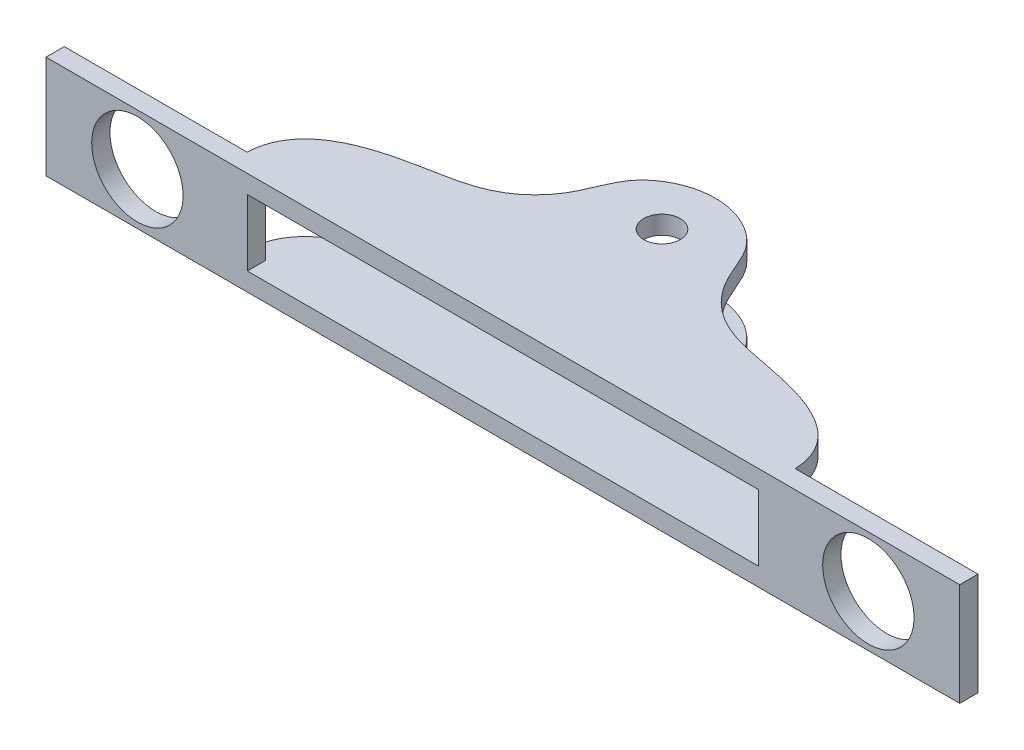
ISO-10303-21;
HEADER;
FILE_DESCRIPTION(('STEP AP214'),'2;1');
FILE_NAME('part.step','',(''),(''),'','','');
FILE_SCHEMA(('AUTOMOTIVE_DESIGN { 1 0 10303 214 1 1 1 1 }'));
ENDSEC;
DATA;
#1=APPLICATION_CONTEXT('core data for automotive mechanical design processes');
#2=APPLICATION_PROTOCOL_DEFINITION('international standard','automotive_design',2000,#1);
#3=PRODUCT_CONTEXT('',#1,'mechanical');
#4=PRODUCT('Part','Part','',(#3));
#5=PRODUCT_RELATED_PRODUCT_CATEGORY('part','',(#4));
#6=PRODUCT_DEFINITION_FORMATION('','',#4);
#7=PRODUCT_DEFINITION_CONTEXT('part definition',#1,'design');
#8=PRODUCT_DEFINITION('design','',#6,#7);
#9=PRODUCT_DEFINITION_SHAPE('','',#8);
#10=(LENGTH_UNIT() NAMED_UNIT(*) SI_UNIT(.MILLI.,.METRE.));
#11=(NAMED_UNIT(*) PLANE_ANGLE_UNIT() SI_UNIT($,.RADIAN.));
#12=(NAMED_UNIT(*) SI_UNIT($,.STERADIAN.) SOLID_ANGLE_UNIT());
#13=UNCERTAINTY_MEASURE_WITH_UNIT(LENGTH_MEASURE(1.E-05),#10,'distance_accuracy_value','');
#14=(GEOMETRIC_REPRESENTATION_CONTEXT(3) GLOBAL_UNCERTAINTY_ASSIGNED_CONTEXT((#13)) GLOBAL_UNIT_ASSIGNED_CONTEXT((#10,
#11,#12)) REPRESENTATION_CONTEXT('',''));
#15=CARTESIAN_POINT('',(0.,0.,0.));
#16=DIRECTION('',(0.,0.,1.));
#17=DIRECTION('',(1.,0.,0.));
#18=AXIS2_PLACEMENT_3D('',#15,#16,#17);
#19=CARTESIAN_POINT('',(0.,3.571875,0.));
#20=DIRECTION('',(0.,0.,-1.));
#21=DIRECTION('',(-1.,0.,0.));
#22=AXIS2_PLACEMENT_3D('',#19,#20,#21);
#23=PLANE('',#22);
#24=CARTESIAN_POINT('',(-25.4,0.,0.));
#25=DIRECTION('',(0.,0.,-1.));
#26=DIRECTION('',(-1.,0.,0.));
#27=AXIS2_PLACEMENT_3D('',#24,#25,#26);
#28=CIRCLE('',#27,3.175);
#29=CARTESIAN_POINT('',(-28.575,0.,0.));
#30=VERTEX_POINT('',#29);
#31=EDGE_CURVE('E244',#30,#30,#28,.T.);
#32=ORIENTED_EDGE('',*,*,#31,.F.);
#33=EDGE_LOOP('',(#32));
#34=FACE_BOUND('',#33,.T.);
#35=DIRECTION('',(0.,1.,0.));
#36=VECTOR('',#35,1.);
#37=CARTESIAN_POINT('',(-17.7571230411786,2.301875,0.));
#38=LINE('',#37,#36);
#39=CARTESIAN_POINT('',(-17.7571230411786,-2.301875,0.));
#40=VERTEX_POINT('',#39);
#41=CARTESIAN_POINT('',(-17.7571230411786,2.301875,0.));
#42=VERTEX_POINT('',#41);
#43=EDGE_CURVE('E58',#40,#42,#38,.T.);
#44=ORIENTED_EDGE('',*,*,#43,.F.);
#45=DIRECTION('',(1.,0.,0.));
#46=VECTOR('',#45,1.);
#47=CARTESIAN_POINT('',(0.,-2.301875,0.));
#48=LINE('',#47,#46);
#49=CARTESIAN_POINT('',(-19.05,-2.301875,0.));
#50=VERTEX_POINT('',#49);
#51=EDGE_CURVE('E247',#50,#40,#48,.T.);
#52=ORIENTED_EDGE('',*,*,#51,.F.);
#53=DIRECTION('',(0.,-1.,0.));
#54=VECTOR('',#53,1.);
#55=CARTESIAN_POINT('',(-19.05,3.571875,0.));
#56=LINE('',#55,#54);
#57=CARTESIAN_POINT('',(-19.05,-3.571875,0.));
#58=VERTEX_POINT('',#57);
#59=EDGE_CURVE('E43',#50,#58,#56,.T.);
#60=ORIENTED_EDGE('',*,*,#59,.T.);
#61=DIRECTION('',(1.,0.,0.));
#62=VECTOR('',#61,1.);
#63=CARTESIAN_POINT('',(0.,-3.571875,0.));
#64=LINE('',#63,#62);
#65=CARTESIAN_POINT('',(-31.75,-3.571875,0.));
#66=VERTEX_POINT('',#65);
#67=EDGE_CURVE('E275',#66,#58,#64,.T.);
#68=ORIENTED_EDGE('',*,*,#67,.F.);
#69=DIRECTION('',(0.,-1.,0.));
#70=VECTOR('',#69,1.);
#71=CARTESIAN_POINT('',(-31.75,3.571875,0.));
#72=LINE('',#71,#70);
#73=CARTESIAN_POINT('',(-31.75,3.571875,0.));
#74=VERTEX_POINT('',#73);
#75=EDGE_CURVE('E319',#74,#66,#72,.T.);
#76=ORIENTED_EDGE('',*,*,#75,.F.);
#77=DIRECTION('',(1.,0.,0.));
#78=VECTOR('',#77,1.);
#79=CARTESIAN_POINT('',(0.,3.571875,0.));
#80=LINE('',#79,#78);
#81=CARTESIAN_POINT('',(-19.05,3.571875,0.));
#82=VERTEX_POINT('',#81);
#83=EDGE_CURVE('E183',#74,#82,#80,.T.);
#84=ORIENTED_EDGE('',*,*,#83,.T.);
#85=CARTESIAN_POINT('',(-19.05,2.301875,0.));
#86=VERTEX_POINT('',#85);
#87=EDGE_CURVE('E11',#82,#86,#56,.T.);
#88=ORIENTED_EDGE('',*,*,#87,.T.);
#89=DIRECTION('',(1.,0.,0.));
#90=VECTOR('',#89,1.);
#91=CARTESIAN_POINT('',(0.,2.301875,0.));
#92=LINE('',#91,#90);
#93=EDGE_CURVE('E158',#86,#42,#92,.T.);
#94=ORIENTED_EDGE('',*,*,#93,.T.);
#95=EDGE_LOOP('',(#44,#52,#60,#68,#76,#84,#88,#94));
#96=FACE_BOUND('',#95,.T.);
#97=ADVANCED_FACE('F34',(#34,#96),#23,.T.);
#98=CARTESIAN_POINT('',(-19.05,3.571875,0.));
#99=CARTESIAN_POINT('',(-18.924950207043,3.571875,-3.11249948959949));
#100=CARTESIAN_POINT('',(-13.8713765267056,3.571875,-5.18268485097122));
#101=CARTESIAN_POINT('',(-8.10041814641702,3.571875,-5.64069188478516));
#102=CARTESIAN_POINT('',(-5.15048706248962,3.571875,-8.71077390469013));
#103=CARTESIAN_POINT('',(-4.23378700622328,3.571875,-12.3346141955239));
#104=CARTESIAN_POINT('',(-1.46476598899125,3.571875,-13.5252143206023));
#105=CARTESIAN_POINT('',(0.,3.571875,-13.4974805585162));
#106=B_SPLINE_CURVE_WITH_KNOTS('',3,(#98,#99,#100,#101,#102,#103,#104,#105),.UNSPECIFIED.,.F.,
.F.,(4,1,1,1,1,4),(0.,0.332448712043005,0.564615598907575,0.691987457165884,0.817131748018574,
1.),.UNSPECIFIED.);
#107=DIRECTION('',(0.,-1.,0.));
#108=VECTOR('',#107,1.);
#109=SURFACE_OF_LINEAR_EXTRUSION('',#106,#108);
#110=ORIENTED_EDGE('',*,*,#59,.F.);
#111=CARTESIAN_POINT('',(-19.05,-2.301875,0.));
#112=CARTESIAN_POINT('',(-18.924950207043,-2.301875,-3.11249948959949));
#113=CARTESIAN_POINT('',(-13.8713765267056,-2.301875,-5.18268485097122));
#114=CARTESIAN_POINT('',(-8.10041814641702,-2.301875,-5.64069188478516));
#115=CARTESIAN_POINT('',(-5.15048706248962,-2.301875,-8.71077390469013));
#116=CARTESIAN_POINT('',(-4.23378700622328,-2.301875,-12.3346141955239));
#117=CARTESIAN_POINT('',(-1.46476598899125,-2.301875,-13.5252143206023));
#118=CARTESIAN_POINT('',(0.,-2.301875,-13.4974805585162));
#119=B_SPLINE_CURVE_WITH_KNOTS('',3,(#111,#112,#113,#114,#115,#116,#117,#118),.UNSPECIFIED.,.F.,
.F.,(4,1,1,1,1,4),(0.,0.332448712043005,0.564615598907575,0.691987457165884,0.817131748018574,
1.),.UNSPECIFIED.);
#120=CARTESIAN_POINT('',(0.,-2.301875,-13.4974805585162));
#121=VERTEX_POINT('',#120);
#122=EDGE_CURVE('E176',#50,#121,#119,.T.);
#123=ORIENTED_EDGE('',*,*,#122,.T.);
#124=DIRECTION('',(0.,-1.,0.));
#125=VECTOR('',#124,1.);
#126=CARTESIAN_POINT('',(0.,3.571875,-13.4974805585162));
#127=LINE('',#126,#125);
#128=CARTESIAN_POINT('',(0.,-3.571875,-13.4974805585162));
#129=VERTEX_POINT('',#128);
#130=EDGE_CURVE('E309',#121,#129,#127,.T.);
#131=ORIENTED_EDGE('',*,*,#130,.T.);
#132=CARTESIAN_POINT('',(-19.05,-3.571875,0.));
#133=CARTESIAN_POINT('',(-18.924950207043,-3.571875,-3.11249948959949));
#134=CARTESIAN_POINT('',(-13.8713765267056,-3.571875,-5.18268485097122));
#135=CARTESIAN_POINT('',(-8.10041814641702,-3.571875,-5.64069188478516));
#136=CARTESIAN_POINT('',(-5.15048706248962,-3.571875,-8.71077390469013));
#137=CARTESIAN_POINT('',(-4.23378700622328,-3.571875,-12.3346141955239));
#138=CARTESIAN_POINT('',(-1.46476598899125,-3.571875,-13.5252143206023));
#139=CARTESIAN_POINT('',(0.,-3.571875,-13.4974805585162));
#140=B_SPLINE_CURVE_WITH_KNOTS('',3,(#132,#133,#134,#135,#136,#137,#138,#139),.UNSPECIFIED.,.F.,
.F.,(4,1,1,1,1,4),(0.,0.332448712043005,0.564615598907575,0.691987457165884,0.817131748018574,
1.),.UNSPECIFIED.);
#141=EDGE_CURVE('E271',#58,#129,#140,.T.);
#142=ORIENTED_EDGE('',*,*,#141,.F.);
#143=EDGE_LOOP('',(#110,#123,#131,#142));
#144=FACE_BOUND('',#143,.T.);
#145=ADVANCED_FACE('F234',(#144),#109,.T.);
#146=CARTESIAN_POINT('',(19.05,3.571875,0.));
#147=CARTESIAN_POINT('',(18.924950207043,3.571875,-3.11249948959949));
#148=CARTESIAN_POINT('',(13.8713765267056,3.571875,-5.18268485097123));
#149=CARTESIAN_POINT('',(8.10041814641702,3.571875,-5.64069188478516));
#150=CARTESIAN_POINT('',(5.15048706248962,3.571875,-8.71077390469013));
#151=CARTESIAN_POINT('',(4.23378700622328,3.571875,-12.3346141955239));
#152=CARTESIAN_POINT('',(1.46476598899125,3.571875,-13.5252143206023));
#153=CARTESIAN_POINT('',(0.,3.571875,-13.4974805585162));
#154=B_SPLINE_CURVE_WITH_KNOTS('',3,(#146,#147,#148,#149,#150,#151,#152,#153),.UNSPECIFIED.,.F.,
.F.,(4,1,1,1,1,4),(0.,0.332448712043005,0.564615598907575,0.691987457165884,0.817131748018574,
1.),.UNSPECIFIED.);
#155=DIRECTION('',(0.,-1.,0.));
#156=VECTOR('',#155,1.);
#157=SURFACE_OF_LINEAR_EXTRUSION('',#154,#156);
#158=CARTESIAN_POINT('',(19.05,-2.301875,0.));
#159=CARTESIAN_POINT('',(18.924950207043,-2.301875,-3.11249948959949));
#160=CARTESIAN_POINT('',(13.8713765267056,-2.301875,-5.18268485097123));
#161=CARTESIAN_POINT('',(8.10041814641702,-2.301875,-5.64069188478516));
#162=CARTESIAN_POINT('',(5.15048706248962,-2.301875,-8.71077390469013));
#163=CARTESIAN_POINT('',(4.23378700622328,-2.301875,-12.3346141955239));
#164=CARTESIAN_POINT('',(1.46476598899125,-2.301875,-13.5252143206023));
#165=CARTESIAN_POINT('',(0.,-2.301875,-13.4974805585162));
#166=B_SPLINE_CURVE_WITH_KNOTS('',3,(#158,#159,#160,#161,#162,#163,#164,#165),.UNSPECIFIED.,.F.,
.F.,(4,1,1,1,1,4),(0.,0.332448712043005,0.564615598907575,0.691987457165884,0.817131748018574,
1.),.UNSPECIFIED.);
#167=CARTESIAN_POINT('',(19.05,-2.301875,0.));
#168=VERTEX_POINT('',#167);
#169=EDGE_CURVE('E257',#168,#121,#166,.T.);
#170=ORIENTED_EDGE('',*,*,#169,.F.);
#171=DIRECTION('',(0.,-1.,0.));
#172=VECTOR('',#171,1.);
#173=CARTESIAN_POINT('',(19.05,3.571875,0.));
#174=LINE('',#173,#172);
#175=CARTESIAN_POINT('',(19.05,-3.571875,0.));
#176=VERTEX_POINT('',#175);
#177=EDGE_CURVE('E308',#168,#176,#174,.T.);
#178=ORIENTED_EDGE('',*,*,#177,.T.);
#179=CARTESIAN_POINT('',(19.05,-3.571875,0.));
#180=CARTESIAN_POINT('',(18.924950207043,-3.571875,-3.11249948959949));
#181=CARTESIAN_POINT('',(13.8713765267056,-3.571875,-5.18268485097123));
#182=CARTESIAN_POINT('',(8.10041814641702,-3.571875,-5.64069188478516));
#183=CARTESIAN_POINT('',(5.15048706248962,-3.571875,-8.71077390469013));
#184=CARTESIAN_POINT('',(4.23378700622328,-3.571875,-12.3346141955239));
#185=CARTESIAN_POINT('',(1.46476598899125,-3.571875,-13.5252143206023));
#186=CARTESIAN_POINT('',(0.,-3.571875,-13.4974805585162));
#187=B_SPLINE_CURVE_WITH_KNOTS('',3,(#179,#180,#181,#182,#183,#184,#185,#186),.UNSPECIFIED.,.F.,
.F.,(4,1,1,1,1,4),(0.,0.332448712043005,0.564615598907575,0.691987457165884,0.817131748018574,
1.),.UNSPECIFIED.);
#188=EDGE_CURVE('E295',#176,#129,#187,.T.);
#189=ORIENTED_EDGE('',*,*,#188,.T.);
#190=ORIENTED_EDGE('',*,*,#130,.F.);
#191=EDGE_LOOP('',(#170,#178,#189,#190));
#192=FACE_BOUND('',#191,.T.);
#193=ADVANCED_FACE('F214',(#192),#157,.F.);
#194=CARTESIAN_POINT('',(0.,3.571875,-9.78780242185548));
#195=DIRECTION('',(0.,-1.,0.));
#196=DIRECTION('',(0.,0.,-1.));
#197=AXIS2_PLACEMENT_3D('',#194,#195,#196);
#198=CYLINDRICAL_SURFACE('',#197,1.27);
#199=CARTESIAN_POINT('',(0.,-3.571875,-9.78780242185548));
#200=DIRECTION('',(0.,1.,0.));
#201=DIRECTION('',(0.,0.,1.));
#202=AXIS2_PLACEMENT_3D('',#199,#200,#201);
#203=CIRCLE('',#202,1.27);
#204=CARTESIAN_POINT('',(0.,-3.571875,-8.51780242185548));
#205=VERTEX_POINT('',#204);
#206=EDGE_CURVE('E184',#205,#205,#203,.T.);
#207=ORIENTED_EDGE('',*,*,#206,.F.);
#208=EDGE_LOOP('',(#207));
#209=FACE_BOUND('',#208,.T.);
#210=CARTESIAN_POINT('',(0.,-2.301875,-9.78780242185548));
#211=DIRECTION('',(0.,1.,0.));
#212=DIRECTION('',(0.,0.,1.));
#213=AXIS2_PLACEMENT_3D('',#210,#211,#212);
#214=CIRCLE('',#213,1.27);
#215=CARTESIAN_POINT('',(0.,-2.301875,-8.51780242185548));
#216=VERTEX_POINT('',#215);
#217=EDGE_CURVE('E259',#216,#216,#214,.T.);
#218=ORIENTED_EDGE('',*,*,#217,.T.);
#219=EDGE_LOOP('',(#218));
#220=FACE_BOUND('',#219,.T.);
#221=ADVANCED_FACE('F232',(#209,#220),#198,.F.);
#222=CARTESIAN_POINT('',(-19.05,2.301875,0.));
#223=CARTESIAN_POINT('',(-18.924950207043,2.301875,-3.11249948959949));
#224=CARTESIAN_POINT('',(-13.8713765267056,2.301875,-5.18268485097122));
#225=CARTESIAN_POINT('',(-8.10041814641702,2.301875,-5.64069188478516));
#226=CARTESIAN_POINT('',(-5.15048706248962,2.301875,-8.71077390469013));
#227=CARTESIAN_POINT('',(-4.23378700622328,2.301875,-12.3346141955239));
#228=CARTESIAN_POINT('',(-1.46476598899125,2.301875,-13.5252143206023));
#229=CARTESIAN_POINT('',(0.,2.301875,-13.4974805585162));
#230=B_SPLINE_CURVE_WITH_KNOTS('',3,(#222,#223,#224,#225,#226,#227,#228,#229),.UNSPECIFIED.,.F.,
.F.,(4,1,1,1,1,4),(0.,0.332448712043005,0.564615598907575,0.691987457165884,0.817131748018574,
1.),.UNSPECIFIED.);
#231=CARTESIAN_POINT('',(0.,2.301875,-13.4974805585162));
#232=VERTEX_POINT('',#231);
#233=EDGE_CURVE('E159',#86,#232,#230,.T.);
#234=ORIENTED_EDGE('',*,*,#233,.F.);
#235=ORIENTED_EDGE('',*,*,#87,.F.);
#236=CARTESIAN_POINT('',(0.,3.571875,-13.4974805585162));
#237=VERTEX_POINT('',#236);
#238=EDGE_CURVE('E177',#82,#237,#106,.T.);
#239=ORIENTED_EDGE('',*,*,#238,.T.);
#240=EDGE_CURVE('E305',#237,#232,#127,.T.);
#241=ORIENTED_EDGE('',*,*,#240,.T.);
#242=EDGE_LOOP('',(#234,#235,#239,#241));
#243=FACE_BOUND('',#242,.T.);
#244=ADVANCED_FACE('F36',(#243),#109,.T.);
#245=CARTESIAN_POINT('',(-31.75,3.571875,0.));
#246=DIRECTION('',(1.,0.,0.));
#247=DIRECTION('',(0.,0.,-1.));
#248=AXIS2_PLACEMENT_3D('',#245,#246,#247);
#249=PLANE('',#248);
#250=DIRECTION('',(0.,0.,1.));
#251=VECTOR('',#250,1.);
#252=CARTESIAN_POINT('',(-31.75,-3.571875,0.));
#253=LINE('',#252,#251);
#254=CARTESIAN_POINT('',(-31.75,-3.571875,1.27));
#255=VERTEX_POINT('',#254);
#256=EDGE_CURVE('E280',#66,#255,#253,.T.);
#257=ORIENTED_EDGE('',*,*,#256,.T.);
#258=DIRECTION('',(0.,-1.,0.));
#259=VECTOR('',#258,1.);
#260=CARTESIAN_POINT('',(-31.75,3.571875,1.27));
#261=LINE('',#260,#259);
#262=CARTESIAN_POINT('',(-31.75,3.571875,1.27));
#263=VERTEX_POINT('',#262);
#264=EDGE_CURVE('E317',#263,#255,#261,.T.);
#265=ORIENTED_EDGE('',*,*,#264,.F.);
#266=DIRECTION('',(0.,0.,1.));
#267=VECTOR('',#266,1.);
#268=CARTESIAN_POINT('',(-31.75,3.571875,0.));
#269=LINE('',#268,#267);
#270=EDGE_CURVE('E190',#74,#263,#269,.T.);
#271=ORIENTED_EDGE('',*,*,#270,.F.);
#272=ORIENTED_EDGE('',*,*,#75,.T.);
#273=EDGE_LOOP('',(#257,#265,#271,#272));
#274=FACE_BOUND('',#273,.T.);
#275=ADVANCED_FACE('F225',(#274),#249,.F.);
#276=CARTESIAN_POINT('',(0.,3.571875,1.27));
#277=DIRECTION('',(0.,0.,-1.));
#278=DIRECTION('',(-1.,0.,0.));
#279=AXIS2_PLACEMENT_3D('',#276,#277,#278);
#280=PLANE('',#279);
#281=CARTESIAN_POINT('',(-25.4,0.,1.27));
#282=DIRECTION('',(0.,0.,-1.));
#283=DIRECTION('',(-1.,0.,0.));
#284=AXIS2_PLACEMENT_3D('',#281,#282,#283);
#285=CIRCLE('',#284,3.175);
#286=CARTESIAN_POINT('',(-28.575,0.,1.27));
#287=VERTEX_POINT('',#286);
#288=EDGE_CURVE('E162',#287,#287,#285,.T.);
#289=ORIENTED_EDGE('',*,*,#288,.T.);
#290=EDGE_LOOP('',(#289));
#291=FACE_BOUND('',#290,.T.);
#292=CARTESIAN_POINT('',(25.4,0.,1.27));
#293=DIRECTION('',(0.,0.,-1.));
#294=DIRECTION('',(-1.,0.,0.));
#295=AXIS2_PLACEMENT_3D('',#292,#293,#294);
#296=CIRCLE('',#295,3.175);
#297=CARTESIAN_POINT('',(22.225,0.,1.27));
#298=VERTEX_POINT('',#297);
#299=EDGE_CURVE('E361',#298,#298,#296,.T.);
#300=ORIENTED_EDGE('',*,*,#299,.T.);
#301=EDGE_LOOP('',(#300));
#302=FACE_BOUND('',#301,.T.);
#303=DIRECTION('',(0.,1.,0.));
#304=VECTOR('',#303,1.);
#305=CARTESIAN_POINT('',(-17.7571230411786,3.571875,1.27));
#306=LINE('',#305,#304);
#307=CARTESIAN_POINT('',(-17.7571230411786,-2.301875,1.27));
#308=VERTEX_POINT('',#307);
#309=CARTESIAN_POINT('',(-17.7571230411786,2.301875,1.27));
#310=VERTEX_POINT('',#309);
#311=EDGE_CURVE('E356',#308,#310,#306,.T.);
#312=ORIENTED_EDGE('',*,*,#311,.T.);
#313=DIRECTION('',(1.,0.,0.));
#314=VECTOR('',#313,1.);
#315=CARTESIAN_POINT('',(0.,2.301875,1.27));
#316=LINE('',#315,#314);
#317=CARTESIAN_POINT('',(17.7571230411786,2.301875,1.27));
#318=VERTEX_POINT('',#317);
#319=EDGE_CURVE('E359',#310,#318,#316,.T.);
#320=ORIENTED_EDGE('',*,*,#319,.T.);
#321=DIRECTION('',(0.,-1.,0.));
#322=VECTOR('',#321,1.);
#323=CARTESIAN_POINT('',(17.7571230411786,3.571875,1.27));
#324=LINE('',#323,#322);
#325=CARTESIAN_POINT('',(17.7571230411786,-2.301875,1.27));
#326=VERTEX_POINT('',#325);
#327=EDGE_CURVE('E141',#318,#326,#324,.T.);
#328=ORIENTED_EDGE('',*,*,#327,.T.);
#329=DIRECTION('',(-1.,0.,0.));
#330=VECTOR('',#329,1.);
#331=CARTESIAN_POINT('',(0.,-2.301875,1.27));
#332=LINE('',#331,#330);
#333=EDGE_CURVE('E348',#326,#308,#332,.T.);
#334=ORIENTED_EDGE('',*,*,#333,.T.);
#335=EDGE_LOOP('',(#312,#320,#328,#334));
#336=FACE_BOUND('',#335,.T.);
#337=DIRECTION('',(1.,0.,0.));
#338=VECTOR('',#337,1.);
#339=CARTESIAN_POINT('',(0.,-3.571875,1.27));
#340=LINE('',#339,#338);
#341=CARTESIAN_POINT('',(31.75,-3.571875,1.27));
#342=VERTEX_POINT('',#341);
#343=EDGE_CURVE('E290',#255,#342,#340,.T.);
#344=ORIENTED_EDGE('',*,*,#343,.T.);
#345=DIRECTION('',(0.,-1.,0.));
#346=VECTOR('',#345,1.);
#347=CARTESIAN_POINT('',(31.75,3.571875,1.27));
#348=LINE('',#347,#346);
#349=CARTESIAN_POINT('',(31.75,3.571875,1.27));
#350=VERTEX_POINT('',#349);
#351=EDGE_CURVE('E314',#350,#342,#348,.T.);
#352=ORIENTED_EDGE('',*,*,#351,.F.);
#353=DIRECTION('',(1.,0.,0.));
#354=VECTOR('',#353,1.);
#355=CARTESIAN_POINT('',(0.,3.571875,1.27));
#356=LINE('',#355,#354);
#357=EDGE_CURVE('E193',#263,#350,#356,.T.);
#358=ORIENTED_EDGE('',*,*,#357,.F.);
#359=ORIENTED_EDGE('',*,*,#264,.T.);
#360=EDGE_LOOP('',(#344,#352,#358,#359));
#361=FACE_BOUND('',#360,.T.);
#362=ADVANCED_FACE('F222',(#291,#302,#336,#361),#280,.F.);
#363=CARTESIAN_POINT('',(31.75,3.571875,0.));
#364=DIRECTION('',(-1.,0.,0.));
#365=DIRECTION('',(0.,0.,1.));
#366=AXIS2_PLACEMENT_3D('',#363,#364,#365);
#367=PLANE('',#366);
#368=DIRECTION('',(0.,0.,-1.));
#369=VECTOR('',#368,1.);
#370=CARTESIAN_POINT('',(31.75,-3.571875,0.));
#371=LINE('',#370,#369);
#372=CARTESIAN_POINT('',(31.75,-3.571875,0.));
#373=VERTEX_POINT('',#372);
#374=EDGE_CURVE('E292',#342,#373,#371,.T.);
#375=ORIENTED_EDGE('',*,*,#374,.T.);
#376=DIRECTION('',(0.,-1.,0.));
#377=VECTOR('',#376,1.);
#378=CARTESIAN_POINT('',(31.75,3.571875,0.));
#379=LINE('',#378,#377);
#380=CARTESIAN_POINT('',(31.75,3.571875,0.));
#381=VERTEX_POINT('',#380);
#382=EDGE_CURVE('E312',#381,#373,#379,.T.);
#383=ORIENTED_EDGE('',*,*,#382,.F.);
#384=DIRECTION('',(0.,0.,-1.));
#385=VECTOR('',#384,1.);
#386=CARTESIAN_POINT('',(31.75,3.571875,0.));
#387=LINE('',#386,#385);
#388=EDGE_CURVE('E195',#350,#381,#387,.T.);
#389=ORIENTED_EDGE('',*,*,#388,.F.);
#390=ORIENTED_EDGE('',*,*,#351,.T.);
#391=EDGE_LOOP('',(#375,#383,#389,#390));
#392=FACE_BOUND('',#391,.T.);
#393=ADVANCED_FACE('F218',(#392),#367,.F.);
#394=CARTESIAN_POINT('',(25.4,0.,0.));
#395=DIRECTION('',(0.,0.,-1.));
#396=DIRECTION('',(-1.,0.,0.));
#397=AXIS2_PLACEMENT_3D('',#394,#395,#396);
#398=CIRCLE('',#397,3.175);
#399=CARTESIAN_POINT('',(22.225,0.,0.));
#400=VERTEX_POINT('',#399);
#401=EDGE_CURVE('E580',#400,#400,#398,.T.);
#402=ORIENTED_EDGE('',*,*,#401,.F.);
#403=EDGE_LOOP('',(#402));
#404=FACE_BOUND('',#403,.T.);
#405=DIRECTION('',(0.,-1.,0.));
#406=VECTOR('',#405,1.);
#407=CARTESIAN_POINT('',(17.7571230411786,2.301875,0.));
#408=LINE('',#407,#406);
#409=CARTESIAN_POINT('',(17.7571230411786,2.301875,0.));
#410=VERTEX_POINT('',#409);
#411=CARTESIAN_POINT('',(17.7571230411786,-2.301875,0.));
#412=VERTEX_POINT('',#411);
#413=EDGE_CURVE('E138',#410,#412,#408,.T.);
#414=ORIENTED_EDGE('',*,*,#413,.F.);
#415=CARTESIAN_POINT('',(19.05,2.301875,0.));
#416=VERTEX_POINT('',#415);
#417=EDGE_CURVE('E148',#410,#416,#92,.T.);
#418=ORIENTED_EDGE('',*,*,#417,.T.);
#419=CARTESIAN_POINT('',(19.05,3.571875,0.));
#420=VERTEX_POINT('',#419);
#421=EDGE_CURVE('E310',#420,#416,#174,.T.);
#422=ORIENTED_EDGE('',*,*,#421,.F.);
#423=EDGE_CURVE('E191',#420,#381,#80,.T.);
#424=ORIENTED_EDGE('',*,*,#423,.T.);
#425=ORIENTED_EDGE('',*,*,#382,.T.);
#426=EDGE_CURVE('E282',#176,#373,#64,.T.);
#427=ORIENTED_EDGE('',*,*,#426,.F.);
#428=ORIENTED_EDGE('',*,*,#177,.F.);
#429=EDGE_CURVE('E151',#412,#168,#48,.T.);
#430=ORIENTED_EDGE('',*,*,#429,.F.);
#431=EDGE_LOOP('',(#414,#418,#422,#424,#425,#427,#428,#430));
#432=FACE_BOUND('',#431,.T.);
#433=ADVANCED_FACE('F147',(#404,#432),#23,.T.);
#434=ORIENTED_EDGE('',*,*,#421,.T.);
#435=CARTESIAN_POINT('',(19.05,2.301875,0.));
#436=CARTESIAN_POINT('',(18.924950207043,2.301875,-3.11249948959949));
#437=CARTESIAN_POINT('',(13.8713765267056,2.301875,-5.18268485097123));
#438=CARTESIAN_POINT('',(8.10041814641702,2.301875,-5.64069188478516));
#439=CARTESIAN_POINT('',(5.15048706248962,2.301875,-8.71077390469013));
#440=CARTESIAN_POINT('',(4.23378700622328,2.301875,-12.3346141955239));
#441=CARTESIAN_POINT('',(1.46476598899125,2.301875,-13.5252143206023));
#442=CARTESIAN_POINT('',(0.,2.301875,-13.4974805585162));
#443=B_SPLINE_CURVE_WITH_KNOTS('',3,(#435,#436,#437,#438,#439,#440,#441,#442),.UNSPECIFIED.,.F.,
.F.,(4,1,1,1,1,4),(0.,0.332448712043005,0.564615598907575,0.691987457165884,0.817131748018574,
1.),.UNSPECIFIED.);
#444=EDGE_CURVE('E156',#416,#232,#443,.T.);
#445=ORIENTED_EDGE('',*,*,#444,.T.);
#446=ORIENTED_EDGE('',*,*,#240,.F.);
#447=EDGE_CURVE('E197',#420,#237,#154,.T.);
#448=ORIENTED_EDGE('',*,*,#447,.F.);
#449=EDGE_LOOP('',(#434,#445,#446,#448));
#450=FACE_BOUND('',#449,.T.);
#451=ADVANCED_FACE('F208',(#450),#157,.F.);
#452=CARTESIAN_POINT('',(0.,2.301875,-9.78780242185548));
#453=DIRECTION('',(0.,1.,0.));
#454=DIRECTION('',(0.,0.,1.));
#455=AXIS2_PLACEMENT_3D('',#452,#453,#454);
#456=CIRCLE('',#455,1.27);
#457=CARTESIAN_POINT('',(0.,2.301875,-8.51780242185548));
#458=VERTEX_POINT('',#457);
#459=EDGE_CURVE('E171',#458,#458,#456,.T.);
#460=ORIENTED_EDGE('',*,*,#459,.F.);
#461=EDGE_LOOP('',(#460));
#462=FACE_BOUND('',#461,.T.);
#463=CARTESIAN_POINT('',(0.,3.571875,-9.78780242185548));
#464=DIRECTION('',(0.,1.,0.));
#465=DIRECTION('',(0.,0.,1.));
#466=AXIS2_PLACEMENT_3D('',#463,#464,#465);
#467=CIRCLE('',#466,1.27);
#468=CARTESIAN_POINT('',(0.,3.571875,-8.51780242185548));
#469=VERTEX_POINT('',#468);
#470=EDGE_CURVE('E202',#469,#469,#467,.T.);
#471=ORIENTED_EDGE('',*,*,#470,.T.);
#472=EDGE_LOOP('',(#471));
#473=FACE_BOUND('',#472,.T.);
#474=ADVANCED_FACE('F212',(#462,#473),#198,.F.);
#475=CARTESIAN_POINT('',(0.,3.571875,0.));
#476=DIRECTION('',(0.,1.,0.));
#477=DIRECTION('',(0.,0.,1.));
#478=AXIS2_PLACEMENT_3D('',#475,#476,#477);
#479=PLANE('',#478);
#480=ORIENTED_EDGE('',*,*,#238,.F.);
#481=ORIENTED_EDGE('',*,*,#83,.F.);
#482=ORIENTED_EDGE('',*,*,#270,.T.);
#483=ORIENTED_EDGE('',*,*,#357,.T.);
#484=ORIENTED_EDGE('',*,*,#388,.T.);
#485=ORIENTED_EDGE('',*,*,#423,.F.);
#486=ORIENTED_EDGE('',*,*,#447,.T.);
#487=EDGE_LOOP('',(#480,#481,#482,#483,#484,#485,#486));
#488=FACE_BOUND('',#487,.T.);
#489=ORIENTED_EDGE('',*,*,#470,.F.);
#490=EDGE_LOOP('',(#489));
#491=FACE_BOUND('',#490,.T.);
#492=ADVANCED_FACE('F335',(#488,#491),#479,.T.);
#493=CARTESIAN_POINT('',(0.,-3.571875,0.));
#494=DIRECTION('',(0.,1.,0.));
#495=DIRECTION('',(0.,0.,1.));
#496=AXIS2_PLACEMENT_3D('',#493,#494,#495);
#497=PLANE('',#496);
#498=ORIENTED_EDGE('',*,*,#141,.T.);
#499=ORIENTED_EDGE('',*,*,#188,.F.);
#500=ORIENTED_EDGE('',*,*,#426,.T.);
#501=ORIENTED_EDGE('',*,*,#374,.F.);
#502=ORIENTED_EDGE('',*,*,#343,.F.);
#503=ORIENTED_EDGE('',*,*,#256,.F.);
#504=ORIENTED_EDGE('',*,*,#67,.T.);
#505=EDGE_LOOP('',(#498,#499,#500,#501,#502,#503,#504));
#506=FACE_BOUND('',#505,.T.);
#507=ORIENTED_EDGE('',*,*,#206,.T.);
#508=EDGE_LOOP('',(#507));
#509=FACE_BOUND('',#508,.T.);
#510=ADVANCED_FACE('F324',(#506,#509),#497,.F.);
#511=CARTESIAN_POINT('',(0.,-2.301875,0.));
#512=DIRECTION('',(0.,1.,0.));
#513=DIRECTION('',(0.,0.,1.));
#514=AXIS2_PLACEMENT_3D('',#511,#512,#513);
#515=PLANE('',#514);
#516=ORIENTED_EDGE('',*,*,#122,.F.);
#517=ORIENTED_EDGE('',*,*,#51,.T.);
#518=DIRECTION('',(0.,0.,-1.));
#519=VECTOR('',#518,1.);
#520=CARTESIAN_POINT('',(-17.7571230411786,-2.301875,4.60375));
#521=LINE('',#520,#519);
#522=EDGE_CURVE('E254',#308,#40,#521,.T.);
#523=ORIENTED_EDGE('',*,*,#522,.F.);
#524=ORIENTED_EDGE('',*,*,#333,.F.);
#525=DIRECTION('',(0.,0.,-1.));
#526=VECTOR('',#525,1.);
#527=CARTESIAN_POINT('',(17.7571230411786,-2.301875,4.60375));
#528=LINE('',#527,#526);
#529=EDGE_CURVE('E50',#326,#412,#528,.T.);
#530=ORIENTED_EDGE('',*,*,#529,.T.);
#531=ORIENTED_EDGE('',*,*,#429,.T.);
#532=ORIENTED_EDGE('',*,*,#169,.T.);
#533=EDGE_LOOP('',(#516,#517,#523,#524,#530,#531,#532));
#534=FACE_BOUND('',#533,.T.);
#535=ORIENTED_EDGE('',*,*,#217,.F.);
#536=EDGE_LOOP('',(#535));
#537=FACE_BOUND('',#536,.T.);
#538=ADVANCED_FACE('F252',(#534,#537),#515,.T.);
#539=CARTESIAN_POINT('',(0.,2.301875,0.));
#540=DIRECTION('',(0.,1.,0.));
#541=DIRECTION('',(0.,0.,1.));
#542=AXIS2_PLACEMENT_3D('',#539,#540,#541);
#543=PLANE('',#542);
#544=ORIENTED_EDGE('',*,*,#233,.T.);
#545=ORIENTED_EDGE('',*,*,#444,.F.);
#546=ORIENTED_EDGE('',*,*,#417,.F.);
#547=DIRECTION('',(0.,0.,-1.));
#548=VECTOR('',#547,1.);
#549=CARTESIAN_POINT('',(17.7571230411786,2.301875,4.60375));
#550=LINE('',#549,#548);
#551=EDGE_CURVE('E135',#318,#410,#550,.T.);
#552=ORIENTED_EDGE('',*,*,#551,.F.);
#553=ORIENTED_EDGE('',*,*,#319,.F.);
#554=DIRECTION('',(0.,0.,-1.));
#555=VECTOR('',#554,1.);
#556=CARTESIAN_POINT('',(-17.7571230411786,2.301875,4.60375));
#557=LINE('',#556,#555);
#558=EDGE_CURVE('E350',#310,#42,#557,.T.);
#559=ORIENTED_EDGE('',*,*,#558,.T.);
#560=ORIENTED_EDGE('',*,*,#93,.F.);
#561=EDGE_LOOP('',(#544,#545,#546,#552,#553,#559,#560));
#562=FACE_BOUND('',#561,.T.);
#563=ORIENTED_EDGE('',*,*,#459,.T.);
#564=EDGE_LOOP('',(#563));
#565=FACE_BOUND('',#564,.T.);
#566=ADVANCED_FACE('F153',(#562,#565),#543,.F.);
#567=CARTESIAN_POINT('',(-17.7571230411786,2.301875,4.60375));
#568=DIRECTION('',(-1.,0.,0.));
#569=DIRECTION('',(0.,0.,1.));
#570=AXIS2_PLACEMENT_3D('',#567,#568,#569);
#571=PLANE('',#570);
#572=ORIENTED_EDGE('',*,*,#522,.T.);
#573=ORIENTED_EDGE('',*,*,#43,.T.);
#574=ORIENTED_EDGE('',*,*,#558,.F.);
#575=ORIENTED_EDGE('',*,*,#311,.F.);
#576=EDGE_LOOP('',(#572,#573,#574,#575));
#577=FACE_BOUND('',#576,.T.);
#578=ADVANCED_FACE('F378',(#577),#571,.F.);
#579=CARTESIAN_POINT('',(17.7571230411786,2.301875,4.60375));
#580=DIRECTION('',(1.,0.,0.));
#581=DIRECTION('',(0.,0.,-1.));
#582=AXIS2_PLACEMENT_3D('',#579,#580,#581);
#583=PLANE('',#582);
#584=ORIENTED_EDGE('',*,*,#551,.T.);
#585=ORIENTED_EDGE('',*,*,#413,.T.);
#586=ORIENTED_EDGE('',*,*,#529,.F.);
#587=ORIENTED_EDGE('',*,*,#327,.F.);
#588=EDGE_LOOP('',(#584,#585,#586,#587));
#589=FACE_BOUND('',#588,.T.);
#590=ADVANCED_FACE('F137',(#589),#583,.F.);
#591=CARTESIAN_POINT('',(25.4,0.,4.60375));
#592=DIRECTION('',(0.,0.,-1.));
#593=DIRECTION('',(-1.,0.,0.));
#594=AXIS2_PLACEMENT_3D('',#591,#592,#593);
#595=CYLINDRICAL_SURFACE('',#594,3.175);
#596=ORIENTED_EDGE('',*,*,#401,.T.);
#597=EDGE_LOOP('',(#596));
#598=FACE_BOUND('',#597,.T.);
#599=ORIENTED_EDGE('',*,*,#299,.F.);
#600=EDGE_LOOP('',(#599));
#601=FACE_BOUND('',#600,.T.);
#602=ADVANCED_FACE('F369',(#598,#601),#595,.F.);
#603=CARTESIAN_POINT('',(-25.4,0.,4.60375));
#604=DIRECTION('',(0.,0.,-1.));
#605=DIRECTION('',(-1.,0.,0.));
#606=AXIS2_PLACEMENT_3D('',#603,#604,#605);
#607=CYLINDRICAL_SURFACE('',#606,3.175);
#608=ORIENTED_EDGE('',*,*,#31,.T.);
#609=EDGE_LOOP('',(#608));
#610=FACE_BOUND('',#609,.T.);
#611=ORIENTED_EDGE('',*,*,#288,.F.);
#612=EDGE_LOOP('',(#611));
#613=FACE_BOUND('',#612,.T.);
#614=ADVANCED_FACE('F367',(#610,#613),#607,.F.);
#615=CLOSED_SHELL('',(#97,#145,#193,#221,#244,#275,#362,#393,#433,#451,#474,#492,#510,#538,#566,
#578,#590,#602,#614));
#616=MANIFOLD_SOLID_BREP('B2',#615);
#617=ADVANCED_BREP_SHAPE_REPRESENTATION('',(#18,#616),#14);
#618=SHAPE_DEFINITION_REPRESENTATION(#9,#617);
ENDSEC;
END-ISO-10303-21;
